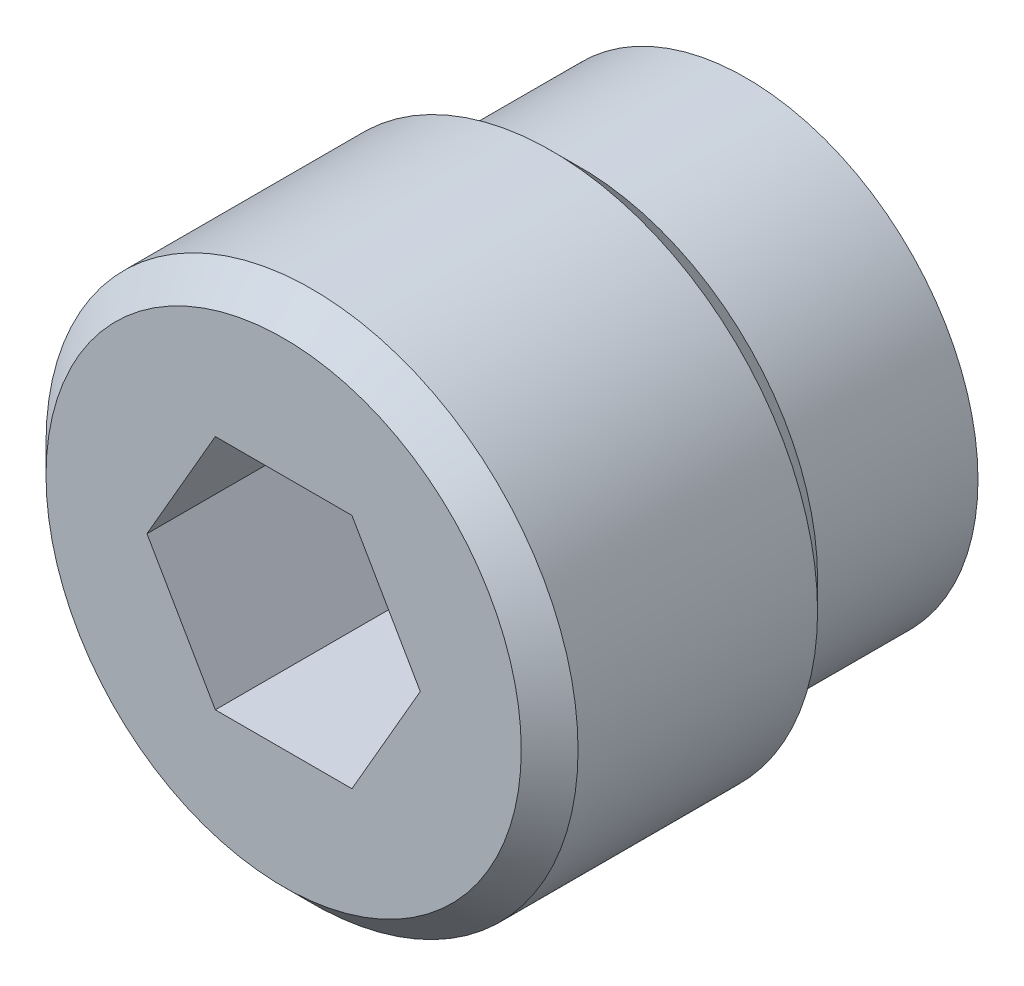
ISO-10303-21;
HEADER;
FILE_DESCRIPTION(('STEP AP214'),'2;1');
FILE_NAME('part.step','',(''),(''),'','','');
FILE_SCHEMA(('AUTOMOTIVE_DESIGN { 1 0 10303 214 1 1 1 1 }'));
ENDSEC;
DATA;
#1=APPLICATION_CONTEXT('core data for automotive mechanical design processes');
#2=APPLICATION_PROTOCOL_DEFINITION('international standard','automotive_design',2000,#1);
#3=PRODUCT_CONTEXT('',#1,'mechanical');
#4=PRODUCT('Part','Part','',(#3));
#5=PRODUCT_RELATED_PRODUCT_CATEGORY('part','',(#4));
#6=PRODUCT_DEFINITION_FORMATION('','',#4);
#7=PRODUCT_DEFINITION_CONTEXT('part definition',#1,'design');
#8=PRODUCT_DEFINITION('design','',#6,#7);
#9=PRODUCT_DEFINITION_SHAPE('','',#8);
#10=(LENGTH_UNIT() NAMED_UNIT(*) SI_UNIT(.MILLI.,.METRE.));
#11=(NAMED_UNIT(*) PLANE_ANGLE_UNIT() SI_UNIT($,.RADIAN.));
#12=(NAMED_UNIT(*) SI_UNIT($,.STERADIAN.) SOLID_ANGLE_UNIT());
#13=UNCERTAINTY_MEASURE_WITH_UNIT(LENGTH_MEASURE(1.E-05),#10,'distance_accuracy_value','');
#14=(GEOMETRIC_REPRESENTATION_CONTEXT(3) GLOBAL_UNCERTAINTY_ASSIGNED_CONTEXT((#13)) GLOBAL_UNIT_ASSIGNED_CONTEXT((#10,
#11,#12)) REPRESENTATION_CONTEXT('',''));
#15=CARTESIAN_POINT('',(0.,0.,0.));
#16=DIRECTION('',(0.,0.,1.));
#17=DIRECTION('',(1.,0.,0.));
#18=AXIS2_PLACEMENT_3D('',#15,#16,#17);
#19=CARTESIAN_POINT('',(0.,0.,-9.6012));
#20=DIRECTION('',(0.,0.,-1.));
#21=DIRECTION('',(-1.,0.,0.));
#22=AXIS2_PLACEMENT_3D('',#19,#20,#21);
#23=PLANE('',#22);
#24=CARTESIAN_POINT('',(0.,0.,-9.6012));
#25=DIRECTION('',(0.,0.,-1.));
#26=DIRECTION('',(-1.,0.,0.));
#27=AXIS2_PLACEMENT_3D('',#24,#25,#26);
#28=CIRCLE('',#27,4.9784);
#29=CARTESIAN_POINT('',(-4.9784,0.,-9.6012));
#30=VERTEX_POINT('',#29);
#31=EDGE_CURVE('E19',#30,#30,#28,.T.);
#32=ORIENTED_EDGE('',*,*,#31,.T.);
#33=EDGE_LOOP('',(#32));
#34=FACE_BOUND('',#33,.T.);
#35=ADVANCED_FACE('F16',(#34),#23,.T.);
#36=CARTESIAN_POINT('',(0.,0.,0.635));
#37=DIRECTION('',(0.,0.,-1.));
#38=DIRECTION('',(-1.,0.,0.));
#39=AXIS2_PLACEMENT_3D('',#36,#37,#38);
#40=CYLINDRICAL_SURFACE('',#39,4.9784);
#41=CARTESIAN_POINT('',(0.,0.,-12.7));
#42=DIRECTION('',(0.,0.,-1.));
#43=DIRECTION('',(-1.,0.,0.));
#44=AXIS2_PLACEMENT_3D('',#41,#42,#43);
#45=CIRCLE('',#44,4.9784);
#46=CARTESIAN_POINT('',(-4.9784,0.,-12.7));
#47=VERTEX_POINT('',#46);
#48=EDGE_CURVE('E110',#47,#47,#45,.F.);
#49=ORIENTED_EDGE('',*,*,#48,.F.);
#50=EDGE_LOOP('',(#49));
#51=FACE_BOUND('',#50,.T.);
#52=ORIENTED_EDGE('',*,*,#31,.F.);
#53=EDGE_LOOP('',(#52));
#54=FACE_BOUND('',#53,.T.);
#55=ADVANCED_FACE('F118',(#51,#54),#40,.F.);
#56=CARTESIAN_POINT('',(0.,0.,-12.7));
#57=DIRECTION('',(0.,0.,-1.));
#58=DIRECTION('',(-1.,0.,0.));
#59=AXIS2_PLACEMENT_3D('',#56,#57,#58);
#60=PLANE('',#59);
#61=ORIENTED_EDGE('',*,*,#48,.T.);
#62=EDGE_LOOP('',(#61));
#63=FACE_BOUND('',#62,.T.);
#64=CARTESIAN_POINT('',(0.,0.,-12.6999999999777));
#65=DIRECTION('',(0.,0.,1.));
#66=DIRECTION('',(1.,0.,0.));
#67=AXIS2_PLACEMENT_3D('',#64,#65,#66);
#68=CIRCLE('',#67,5.7149999999524);
#69=CARTESIAN_POINT('',(5.7149999999524,0.,-12.6999999999777));
#70=VERTEX_POINT('',#69);
#71=EDGE_CURVE('E97',#70,#70,#68,.T.);
#72=ORIENTED_EDGE('',*,*,#71,.F.);
#73=EDGE_LOOP('',(#72));
#74=FACE_BOUND('',#73,.T.);
#75=ADVANCED_FACE('F120',(#63,#74),#60,.T.);
#76=CARTESIAN_POINT('',(0.,0.,-12.4067060633593));
#77=DIRECTION('',(0.,0.,1.));
#78=DIRECTION('',(1.,0.,0.));
#79=AXIS2_PLACEMENT_3D('',#76,#77,#78);
#80=CONICAL_SURFACE('',#79,6.22299999974985,1.04719755121572);
#81=ORIENTED_EDGE('',*,*,#71,.T.);
#82=EDGE_LOOP('',(#81));
#83=FACE_BOUND('',#82,.T.);
#84=CARTESIAN_POINT('',(0.,0.,-12.4067060632515));
#85=DIRECTION('',(0.,0.,-1.));
#86=DIRECTION('',(-1.,0.,0.));
#87=AXIS2_PLACEMENT_3D('',#84,#85,#86);
#88=CIRCLE('',#87,6.223);
#89=CARTESIAN_POINT('',(-6.223,0.,-12.4067060632515));
#90=VERTEX_POINT('',#89);
#91=EDGE_CURVE('E77',#90,#90,#88,.F.);
#92=ORIENTED_EDGE('',*,*,#91,.F.);
#93=EDGE_LOOP('',(#92));
#94=FACE_BOUND('',#93,.T.);
#95=ADVANCED_FACE('F127',(#83,#94),#80,.T.);
#96=CARTESIAN_POINT('',(0.,0.,-4.7752));
#97=DIRECTION('',(0.,0.,-1.));
#98=DIRECTION('',(-1.,0.,0.));
#99=AXIS2_PLACEMENT_3D('',#96,#97,#98);
#100=PLANE('',#99);
#101=DIRECTION('',(-0.500000000000017,-0.866025403784429,0.));
#102=VECTOR('',#101,1.);
#103=CARTESIAN_POINT('',(-1.83308710467698,3.175,-4.7752));
#104=LINE('',#103,#102);
#105=CARTESIAN_POINT('',(-1.83308710467698,3.175,-4.7752));
#106=VERTEX_POINT('',#105);
#107=CARTESIAN_POINT('',(-3.66617420935399,0.,-4.7752));
#108=VERTEX_POINT('',#107);
#109=EDGE_CURVE('E86',#106,#108,#104,.T.);
#110=ORIENTED_EDGE('',*,*,#109,.T.);
#111=DIRECTION('',(0.500000000000017,-0.866025403784429,0.));
#112=VECTOR('',#111,1.);
#113=CARTESIAN_POINT('',(-3.66617420935396,0.,-4.7752));
#114=LINE('',#113,#112);
#115=CARTESIAN_POINT('',(-1.83308710467695,-3.17499999999998,-4.7752));
#116=VERTEX_POINT('',#115);
#117=EDGE_CURVE('E276',#108,#116,#114,.T.);
#118=ORIENTED_EDGE('',*,*,#117,.T.);
#119=DIRECTION('',(1.,0.,0.));
#120=VECTOR('',#119,1.);
#121=CARTESIAN_POINT('',(-1.83308710467698,-3.175,-4.7752));
#122=LINE('',#121,#120);
#123=CARTESIAN_POINT('',(1.83308710467698,-3.175,-4.7752));
#124=VERTEX_POINT('',#123);
#125=EDGE_CURVE('E271',#116,#124,#122,.T.);
#126=ORIENTED_EDGE('',*,*,#125,.T.);
#127=DIRECTION('',(0.500000000000017,0.866025403784429,0.));
#128=VECTOR('',#127,1.);
#129=CARTESIAN_POINT('',(1.83308710467698,-3.175,-4.7752));
#130=LINE('',#129,#128);
#131=CARTESIAN_POINT('',(3.66617420935399,0.,-4.7752));
#132=VERTEX_POINT('',#131);
#133=EDGE_CURVE('E74',#124,#132,#130,.T.);
#134=ORIENTED_EDGE('',*,*,#133,.T.);
#135=DIRECTION('',(-0.500000000000017,0.866025403784429,0.));
#136=VECTOR('',#135,1.);
#137=CARTESIAN_POINT('',(3.66617420935396,0.,-4.7752));
#138=LINE('',#137,#136);
#139=CARTESIAN_POINT('',(1.83308710467695,3.17499999999998,-4.7752));
#140=VERTEX_POINT('',#139);
#141=EDGE_CURVE('E70',#132,#140,#138,.T.);
#142=ORIENTED_EDGE('',*,*,#141,.T.);
#143=DIRECTION('',(1.,0.,0.));
#144=VECTOR('',#143,1.);
#145=CARTESIAN_POINT('',(1.83308710467698,3.175,-4.7752));
#146=LINE('',#145,#144);
#147=EDGE_CURVE('E67',#140,#106,#146,.F.);
#148=ORIENTED_EDGE('',*,*,#147,.T.);
#149=EDGE_LOOP('',(#110,#118,#126,#134,#142,#148));
#150=FACE_BOUND('',#149,.T.);
#151=ADVANCED_FACE('F72',(#150),#100,.F.);
#152=CARTESIAN_POINT('',(0.,0.,0.635));
#153=DIRECTION('',(0.,0.,-1.));
#154=DIRECTION('',(-1.,0.,0.));
#155=AXIS2_PLACEMENT_3D('',#152,#153,#154);
#156=CYLINDRICAL_SURFACE('',#155,6.223);
#157=CARTESIAN_POINT('',(0.,0.,-7.9502));
#158=DIRECTION('',(0.,0.,-1.));
#159=DIRECTION('',(-1.,0.,0.));
#160=AXIS2_PLACEMENT_3D('',#157,#158,#159);
#161=CIRCLE('',#160,6.223);
#162=CARTESIAN_POINT('',(-6.223,0.,-7.9502));
#163=VERTEX_POINT('',#162);
#164=EDGE_CURVE('E105',#163,#163,#161,.F.);
#165=ORIENTED_EDGE('',*,*,#164,.F.);
#166=EDGE_LOOP('',(#165));
#167=FACE_BOUND('',#166,.T.);
#168=ORIENTED_EDGE('',*,*,#91,.T.);
#169=EDGE_LOOP('',(#168));
#170=FACE_BOUND('',#169,.T.);
#171=ADVANCED_FACE('F173',(#167,#170),#156,.T.);
#172=CARTESIAN_POINT('',(3.66617420935396,0.,0.));
#173=DIRECTION('',(0.866025403784429,0.500000000000017,0.));
#174=DIRECTION('',(-0.500000000000017,0.866025403784429,0.));
#175=AXIS2_PLACEMENT_3D('',#172,#173,#174);
#176=PLANE('',#175);
#177=DIRECTION('',(-0.499999999999983,0.866025403784448,0.));
#178=VECTOR('',#177,1.);
#179=CARTESIAN_POINT('',(3.66617420935396,0.,0.));
#180=LINE('',#179,#178);
#181=CARTESIAN_POINT('',(3.66617420935399,0.,0.));
#182=VERTEX_POINT('',#181);
#183=CARTESIAN_POINT('',(1.83308710467692,3.17499999999996,0.));
#184=VERTEX_POINT('',#183);
#185=EDGE_CURVE('E83',#182,#184,#180,.T.);
#186=ORIENTED_EDGE('',*,*,#185,.T.);
#187=DIRECTION('',(0.,0.,1.));
#188=VECTOR('',#187,1.);
#189=CARTESIAN_POINT('',(1.83308710467698,3.175,0.));
#190=LINE('',#189,#188);
#191=EDGE_CURVE('E80',#184,#140,#190,.F.);
#192=ORIENTED_EDGE('',*,*,#191,.T.);
#193=ORIENTED_EDGE('',*,*,#141,.F.);
#194=DIRECTION('',(0.,0.,1.));
#195=VECTOR('',#194,1.);
#196=CARTESIAN_POINT('',(3.66617420935408,0.,0.));
#197=LINE('',#196,#195);
#198=EDGE_CURVE('E265',#132,#182,#197,.T.);
#199=ORIENTED_EDGE('',*,*,#198,.T.);
#200=EDGE_LOOP('',(#186,#192,#193,#199));
#201=FACE_BOUND('',#200,.T.);
#202=ADVANCED_FACE('F81',(#201),#176,.F.);
#203=CARTESIAN_POINT('',(1.83308710467698,3.175,0.));
#204=DIRECTION('',(0.,1.,0.));
#205=DIRECTION('',(0.,0.,1.));
#206=AXIS2_PLACEMENT_3D('',#203,#204,#205);
#207=PLANE('',#206);
#208=DIRECTION('',(-1.,0.,0.));
#209=VECTOR('',#208,1.);
#210=CARTESIAN_POINT('',(0.,3.175,0.));
#211=LINE('',#210,#209);
#212=CARTESIAN_POINT('',(-1.83308710467698,3.175,0.));
#213=VERTEX_POINT('',#212);
#214=EDGE_CURVE('E289',#184,#213,#211,.T.);
#215=ORIENTED_EDGE('',*,*,#214,.T.);
#216=DIRECTION('',(0.,0.,1.));
#217=VECTOR('',#216,1.);
#218=CARTESIAN_POINT('',(-1.83308710467698,3.175,0.));
#219=LINE('',#218,#217);
#220=EDGE_CURVE('E90',#213,#106,#219,.F.);
#221=ORIENTED_EDGE('',*,*,#220,.T.);
#222=ORIENTED_EDGE('',*,*,#147,.F.);
#223=ORIENTED_EDGE('',*,*,#191,.F.);
#224=EDGE_LOOP('',(#215,#221,#222,#223));
#225=FACE_BOUND('',#224,.T.);
#226=ADVANCED_FACE('F88',(#225),#207,.F.);
#227=CARTESIAN_POINT('',(-1.83308710467698,3.175,0.));
#228=DIRECTION('',(-0.866025403784429,0.500000000000017,0.));
#229=DIRECTION('',(-0.500000000000017,-0.866025403784429,0.));
#230=AXIS2_PLACEMENT_3D('',#227,#228,#229);
#231=PLANE('',#230);
#232=DIRECTION('',(-0.499999999999983,-0.866025403784448,0.));
#233=VECTOR('',#232,1.);
#234=CARTESIAN_POINT('',(-1.83308710467698,3.175,0.));
#235=LINE('',#234,#233);
#236=CARTESIAN_POINT('',(-3.66617420935402,0.,0.));
#237=VERTEX_POINT('',#236);
#238=EDGE_CURVE('E281',#213,#237,#235,.T.);
#239=ORIENTED_EDGE('',*,*,#238,.T.);
#240=DIRECTION('',(0.,0.,1.));
#241=VECTOR('',#240,1.);
#242=CARTESIAN_POINT('',(-3.66617420935396,0.,0.));
#243=LINE('',#242,#241);
#244=EDGE_CURVE('E273',#237,#108,#243,.F.);
#245=ORIENTED_EDGE('',*,*,#244,.T.);
#246=ORIENTED_EDGE('',*,*,#109,.F.);
#247=ORIENTED_EDGE('',*,*,#220,.F.);
#248=EDGE_LOOP('',(#239,#245,#246,#247));
#249=FACE_BOUND('',#248,.T.);
#250=ADVANCED_FACE('F164',(#249),#231,.F.);
#251=CARTESIAN_POINT('',(-3.66617420935396,0.,0.));
#252=DIRECTION('',(-0.866025403784429,-0.500000000000017,0.));
#253=DIRECTION('',(0.500000000000017,-0.866025403784429,0.));
#254=AXIS2_PLACEMENT_3D('',#251,#252,#253);
#255=PLANE('',#254);
#256=DIRECTION('',(0.499999999999983,-0.866025403784448,0.));
#257=VECTOR('',#256,1.);
#258=CARTESIAN_POINT('',(-3.66617420935396,0.,0.));
#259=LINE('',#258,#257);
#260=CARTESIAN_POINT('',(-1.83308710467692,-3.17499999999996,0.));
#261=VERTEX_POINT('',#260);
#262=EDGE_CURVE('E284',#237,#261,#259,.T.);
#263=ORIENTED_EDGE('',*,*,#262,.T.);
#264=DIRECTION('',(0.,0.,-1.));
#265=VECTOR('',#264,1.);
#266=CARTESIAN_POINT('',(-1.83308710467698,-3.175,0.));
#267=LINE('',#266,#265);
#268=EDGE_CURVE('E268',#261,#116,#267,.T.);
#269=ORIENTED_EDGE('',*,*,#268,.T.);
#270=ORIENTED_EDGE('',*,*,#117,.F.);
#271=ORIENTED_EDGE('',*,*,#244,.F.);
#272=EDGE_LOOP('',(#263,#269,#270,#271));
#273=FACE_BOUND('',#272,.T.);
#274=ADVANCED_FACE('F161',(#273),#255,.F.);
#275=CARTESIAN_POINT('',(-1.83308710467698,-3.175,0.));
#276=DIRECTION('',(0.,-1.,0.));
#277=DIRECTION('',(0.,0.,-1.));
#278=AXIS2_PLACEMENT_3D('',#275,#276,#277);
#279=PLANE('',#278);
#280=DIRECTION('',(-1.,0.,0.));
#281=VECTOR('',#280,1.);
#282=CARTESIAN_POINT('',(0.,-3.175,0.));
#283=LINE('',#282,#281);
#284=CARTESIAN_POINT('',(1.83308710467698,-3.175,0.));
#285=VERTEX_POINT('',#284);
#286=EDGE_CURVE('E34',#261,#285,#283,.F.);
#287=ORIENTED_EDGE('',*,*,#286,.T.);
#288=DIRECTION('',(0.,0.,1.));
#289=VECTOR('',#288,1.);
#290=CARTESIAN_POINT('',(1.83308710467698,-3.175,0.));
#291=LINE('',#290,#289);
#292=EDGE_CURVE('E108',#285,#124,#291,.F.);
#293=ORIENTED_EDGE('',*,*,#292,.T.);
#294=ORIENTED_EDGE('',*,*,#125,.F.);
#295=ORIENTED_EDGE('',*,*,#268,.F.);
#296=EDGE_LOOP('',(#287,#293,#294,#295));
#297=FACE_BOUND('',#296,.T.);
#298=ADVANCED_FACE('F157',(#297),#279,.F.);
#299=CARTESIAN_POINT('',(1.83308710467698,-3.175,0.));
#300=DIRECTION('',(0.866025403784429,-0.500000000000017,0.));
#301=DIRECTION('',(0.500000000000017,0.866025403784429,0.));
#302=AXIS2_PLACEMENT_3D('',#299,#300,#301);
#303=PLANE('',#302);
#304=DIRECTION('',(0.499999999999983,0.866025403784448,0.));
#305=VECTOR('',#304,1.);
#306=CARTESIAN_POINT('',(1.83308710467698,-3.175,0.));
#307=LINE('',#306,#305);
#308=EDGE_CURVE('E104',#285,#182,#307,.T.);
#309=ORIENTED_EDGE('',*,*,#308,.T.);
#310=ORIENTED_EDGE('',*,*,#198,.F.);
#311=ORIENTED_EDGE('',*,*,#133,.F.);
#312=ORIENTED_EDGE('',*,*,#292,.F.);
#313=EDGE_LOOP('',(#309,#310,#311,#312));
#314=FACE_BOUND('',#313,.T.);
#315=ADVANCED_FACE('F153',(#314),#303,.F.);
#316=CARTESIAN_POINT('',(0.,0.,-7.9502));
#317=DIRECTION('',(0.,0.,-1.));
#318=DIRECTION('',(-1.,0.,0.));
#319=AXIS2_PLACEMENT_3D('',#316,#317,#318);
#320=PLANE('',#319);
#321=ORIENTED_EDGE('',*,*,#164,.T.);
#322=EDGE_LOOP('',(#321));
#323=FACE_BOUND('',#322,.T.);
#324=CARTESIAN_POINT('',(0.,0.,-7.95020000003888));
#325=DIRECTION('',(0.,0.,1.));
#326=DIRECTION('',(1.,0.,0.));
#327=AXIS2_PLACEMENT_3D('',#324,#325,#326);
#328=CIRCLE('',#327,6.37540000002446);
#329=CARTESIAN_POINT('',(6.37540000002446,0.,-7.95020000003888));
#330=VERTEX_POINT('',#329);
#331=EDGE_CURVE('E101',#330,#330,#328,.T.);
#332=ORIENTED_EDGE('',*,*,#331,.F.);
#333=EDGE_LOOP('',(#332));
#334=FACE_BOUND('',#333,.T.);
#335=ADVANCED_FACE('F149',(#323,#334),#320,.T.);
#336=CARTESIAN_POINT('',(0.,0.,0.));
#337=DIRECTION('',(0.,0.,-1.));
#338=DIRECTION('',(-1.,0.,0.));
#339=AXIS2_PLACEMENT_3D('',#336,#337,#338);
#340=PLANE('',#339);
#341=ORIENTED_EDGE('',*,*,#286,.F.);
#342=ORIENTED_EDGE('',*,*,#262,.F.);
#343=ORIENTED_EDGE('',*,*,#238,.F.);
#344=ORIENTED_EDGE('',*,*,#214,.F.);
#345=ORIENTED_EDGE('',*,*,#185,.F.);
#346=ORIENTED_EDGE('',*,*,#308,.F.);
#347=EDGE_LOOP('',(#341,#342,#343,#344,#345,#346));
#348=FACE_BOUND('',#347,.T.);
#349=CARTESIAN_POINT('',(0.,0.,-5.6843418860808E-11));
#350=DIRECTION('',(0.,0.,-1.));
#351=DIRECTION('',(-1.,0.,0.));
#352=AXIS2_PLACEMENT_3D('',#349,#350,#351);
#353=CIRCLE('',#352,6.37539999996761);
#354=CARTESIAN_POINT('',(-6.37539999996761,0.,-5.6843418860808E-11));
#355=VERTEX_POINT('',#354);
#356=EDGE_CURVE('E98',#355,#355,#353,.T.);
#357=ORIENTED_EDGE('',*,*,#356,.F.);
#358=EDGE_LOOP('',(#357));
#359=FACE_BOUND('',#358,.T.);
#360=ADVANCED_FACE('F145',(#348,#359),#340,.F.);
#361=CARTESIAN_POINT('',(0.,0.,-7.18819999997322));
#362=DIRECTION('',(0.,0.,1.));
#363=DIRECTION('',(1.,0.,0.));
#364=AXIS2_PLACEMENT_3D('',#361,#362,#363);
#365=CONICAL_SURFACE('',#364,7.13740000003327,0.785398163360149);
#366=ORIENTED_EDGE('',*,*,#331,.T.);
#367=EDGE_LOOP('',(#366));
#368=FACE_BOUND('',#367,.T.);
#369=CARTESIAN_POINT('',(0.,0.,-7.1882));
#370=DIRECTION('',(0.,0.,-1.));
#371=DIRECTION('',(-1.,0.,0.));
#372=AXIS2_PLACEMENT_3D('',#369,#370,#371);
#373=CIRCLE('',#372,7.1374);
#374=CARTESIAN_POINT('',(-7.1374,0.,-7.1882));
#375=VERTEX_POINT('',#374);
#376=EDGE_CURVE('E25',#375,#375,#373,.F.);
#377=ORIENTED_EDGE('',*,*,#376,.F.);
#378=EDGE_LOOP('',(#377));
#379=FACE_BOUND('',#378,.T.);
#380=ADVANCED_FACE('F137',(#368,#379),#365,.T.);
#381=CARTESIAN_POINT('',(0.,0.,-0.761999999951968));
#382=DIRECTION('',(0.,0.,-1.));
#383=DIRECTION('',(-1.,0.,0.));
#384=AXIS2_PLACEMENT_3D('',#381,#382,#383);
#385=CONICAL_SURFACE('',#384,7.13739999986274,0.785398163397448);
#386=CARTESIAN_POINT('',(0.,0.,-0.762));
#387=DIRECTION('',(0.,0.,-1.));
#388=DIRECTION('',(-1.,0.,0.));
#389=AXIS2_PLACEMENT_3D('',#386,#387,#388);
#390=CIRCLE('',#389,7.1374);
#391=CARTESIAN_POINT('',(-7.1374,0.,-0.762));
#392=VERTEX_POINT('',#391);
#393=EDGE_CURVE('E10',#392,#392,#390,.T.);
#394=ORIENTED_EDGE('',*,*,#393,.F.);
#395=EDGE_LOOP('',(#394));
#396=FACE_BOUND('',#395,.T.);
#397=ORIENTED_EDGE('',*,*,#356,.T.);
#398=EDGE_LOOP('',(#397));
#399=FACE_BOUND('',#398,.T.);
#400=ADVANCED_FACE('F131',(#396,#399),#385,.T.);
#401=CARTESIAN_POINT('',(0.,0.,0.635));
#402=DIRECTION('',(0.,0.,-1.));
#403=DIRECTION('',(-1.,0.,0.));
#404=AXIS2_PLACEMENT_3D('',#401,#402,#403);
#405=CYLINDRICAL_SURFACE('',#404,7.1374);
#406=ORIENTED_EDGE('',*,*,#376,.T.);
#407=EDGE_LOOP('',(#406));
#408=FACE_BOUND('',#407,.T.);
#409=ORIENTED_EDGE('',*,*,#393,.T.);
#410=EDGE_LOOP('',(#409));
#411=FACE_BOUND('',#410,.T.);
#412=ADVANCED_FACE('F129',(#408,#411),#405,.T.);
#413=CLOSED_SHELL('',(#35,#55,#75,#95,#151,#171,#202,#226,#250,#274,#298,#315,#335,#360,#380,
#400,#412));
#414=MANIFOLD_SOLID_BREP('B1',#413);
#415=ADVANCED_BREP_SHAPE_REPRESENTATION('',(#18,#414),#14);
#416=SHAPE_DEFINITION_REPRESENTATION(#9,#415);
ENDSEC;
END-ISO-10303-21;
